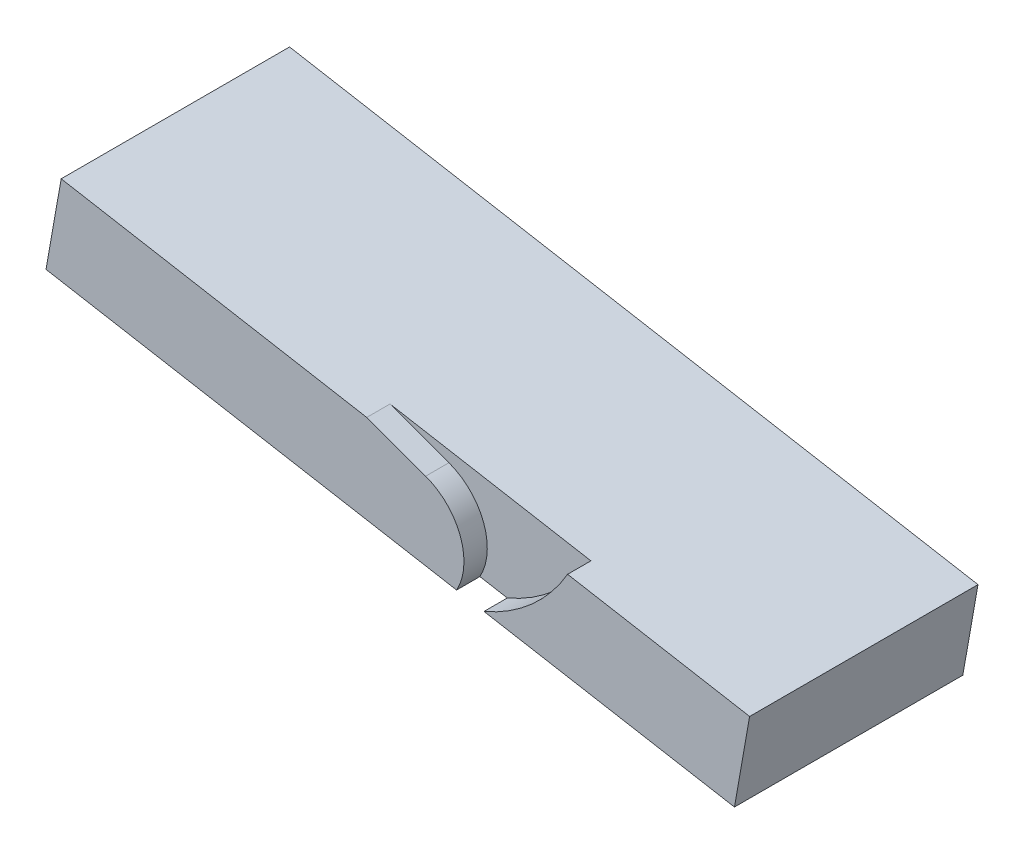
ISO-10303-21;
HEADER;
FILE_DESCRIPTION(('STEP AP214'),'2;1');
FILE_NAME('part.step','',(''),(''),'','','');
FILE_SCHEMA(('AUTOMOTIVE_DESIGN { 1 0 10303 214 1 1 1 1 }'));
ENDSEC;
DATA;
#1=APPLICATION_CONTEXT('core data for automotive mechanical design processes');
#2=APPLICATION_PROTOCOL_DEFINITION('international standard','automotive_design',2000,#1);
#3=PRODUCT_CONTEXT('',#1,'mechanical');
#4=PRODUCT('Part','Part','',(#3));
#5=PRODUCT_RELATED_PRODUCT_CATEGORY('part','',(#4));
#6=PRODUCT_DEFINITION_FORMATION('','',#4);
#7=PRODUCT_DEFINITION_CONTEXT('part definition',#1,'design');
#8=PRODUCT_DEFINITION('design','',#6,#7);
#9=PRODUCT_DEFINITION_SHAPE('','',#8);
#10=(LENGTH_UNIT() NAMED_UNIT(*) SI_UNIT(.MILLI.,.METRE.));
#11=(NAMED_UNIT(*) PLANE_ANGLE_UNIT() SI_UNIT($,.RADIAN.));
#12=(NAMED_UNIT(*) SI_UNIT($,.STERADIAN.) SOLID_ANGLE_UNIT());
#13=UNCERTAINTY_MEASURE_WITH_UNIT(LENGTH_MEASURE(1.E-05),#10,'distance_accuracy_value','');
#14=(GEOMETRIC_REPRESENTATION_CONTEXT(3) GLOBAL_UNCERTAINTY_ASSIGNED_CONTEXT((#13)) GLOBAL_UNIT_ASSIGNED_CONTEXT((#10,
#11,#12)) REPRESENTATION_CONTEXT('',''));
#15=CARTESIAN_POINT('',(0.,0.,0.));
#16=DIRECTION('',(0.,0.,1.));
#17=DIRECTION('',(1.,0.,0.));
#18=AXIS2_PLACEMENT_3D('',#15,#16,#17);
#19=CARTESIAN_POINT('',(-4.34365582023604,-40.135903716019,3.048));
#20=DIRECTION('',(0.,0.,-1.));
#21=DIRECTION('',(-1.,0.,0.));
#22=AXIS2_PLACEMENT_3D('',#19,#20,#21);
#23=CYLINDRICAL_SURFACE('',#22,12.7);
#24=CARTESIAN_POINT('',(-4.34365582023604,-40.135903716019,-3.048));
#25=DIRECTION('',(0.,0.,1.));
#26=DIRECTION('',(1.,0.,0.));
#27=AXIS2_PLACEMENT_3D('',#24,#25,#26);
#28=CIRCLE('',#27,12.7);
#29=CARTESIAN_POINT('',(6.74608058450968,-46.325228919404,-3.048));
#30=VERTEX_POINT('',#29);
#31=CARTESIAN_POINT('',(0.,-28.2018074320379,-3.048));
#32=VERTEX_POINT('',#31);
#33=EDGE_CURVE('E127',#30,#32,#28,.T.);
#34=ORIENTED_EDGE('',*,*,#33,.T.);
#35=DIRECTION('',(0.,0.,-1.));
#36=VECTOR('',#35,1.);
#37=CARTESIAN_POINT('',(0.,-28.2018074320379,3.048));
#38=LINE('',#37,#36);
#39=CARTESIAN_POINT('',(0.,-28.2018074320379,2.032));
#40=VERTEX_POINT('',#39);
#41=EDGE_CURVE('E113',#40,#32,#38,.T.);
#42=ORIENTED_EDGE('',*,*,#41,.F.);
#43=CARTESIAN_POINT('',(-4.34365582023604,-40.135903716019,2.032));
#44=DIRECTION('',(0.,0.,1.));
#45=DIRECTION('',(1.,0.,0.));
#46=AXIS2_PLACEMENT_3D('',#43,#44,#45);
#47=CIRCLE('',#46,12.7);
#48=CARTESIAN_POINT('',(6.74608058450968,-46.325228919404,2.032));
#49=VERTEX_POINT('',#48);
#50=EDGE_CURVE('E123',#40,#49,#47,.F.);
#51=ORIENTED_EDGE('',*,*,#50,.T.);
#52=DIRECTION('',(0.,0.,-1.));
#53=VECTOR('',#52,1.);
#54=CARTESIAN_POINT('',(6.74608058450968,-46.325228919404,3.048));
#55=LINE('',#54,#53);
#56=EDGE_CURVE('E128',#30,#49,#55,.F.);
#57=ORIENTED_EDGE('',*,*,#56,.F.);
#58=EDGE_LOOP('',(#34,#42,#51,#57));
#59=FACE_BOUND('',#58,.T.);
#60=ADVANCED_FACE('F37',(#59),#23,.T.);
#61=CARTESIAN_POINT('',(-9.06388619403997,-24.902822650631,3.048));
#62=DIRECTION('',(-0.342020143325673,-0.939692620785907,0.));
#63=DIRECTION('',(0.939692620785907,-0.342020143325673,0.));
#64=AXIS2_PLACEMENT_3D('',#61,#62,#63);
#65=PLANE('',#64);
#66=DIRECTION('',(0.939692620785907,-0.342020143325673,0.));
#67=VECTOR('',#66,1.);
#68=CARTESIAN_POINT('',(-9.06388619403997,-24.902822650631,2.032));
#69=LINE('',#68,#67);
#70=CARTESIAN_POINT('',(-12.8433687033597,-23.5272035163089,2.032));
#71=VERTEX_POINT('',#70);
#72=EDGE_CURVE('E120',#71,#40,#69,.T.);
#73=ORIENTED_EDGE('',*,*,#72,.T.);
#74=ORIENTED_EDGE('',*,*,#41,.T.);
#75=DIRECTION('',(-0.939692620785907,0.342020143325673,0.));
#76=VECTOR('',#75,1.);
#77=CARTESIAN_POINT('',(-9.06388619403997,-24.902822650631,-3.048));
#78=LINE('',#77,#76);
#79=CARTESIAN_POINT('',(-12.8433687033593,-23.527203516309,-3.048));
#80=VERTEX_POINT('',#79);
#81=EDGE_CURVE('E117',#32,#80,#78,.T.);
#82=ORIENTED_EDGE('',*,*,#81,.T.);
#83=DIRECTION('',(0.,0.,-1.));
#84=VECTOR('',#83,1.);
#85=CARTESIAN_POINT('',(-12.8433687033593,-23.527203516309,162.968548839141));
#86=LINE('',#85,#84);
#87=EDGE_CURVE('E150',#71,#80,#86,.T.);
#88=ORIENTED_EDGE('',*,*,#87,.F.);
#89=EDGE_LOOP('',(#73,#74,#82,#88));
#90=FACE_BOUND('',#89,.T.);
#91=ADVANCED_FACE('F115',(#90),#65,.F.);
#92=CARTESIAN_POINT('',(0.,0.,-3.048));
#93=DIRECTION('',(0.,0.,1.));
#94=DIRECTION('',(1.,0.,0.));
#95=AXIS2_PLACEMENT_3D('',#92,#93,#94);
#96=PLANE('',#95);
#97=DIRECTION('',(0.984807753012207,-0.173648177666934,0.));
#98=VECTOR('',#97,1.);
#99=CARTESIAN_POINT('',(-82.7610122768255,-30.5427134831723,-3.048));
#100=LINE('',#99,#98);
#101=CARTESIAN_POINT('',(12.7189421269623,-47.3784055613744,-3.048));
#102=VERTEX_POINT('',#101);
#103=EDGE_CURVE('E144',#30,#102,#100,.T.);
#104=ORIENTED_EDGE('',*,*,#103,.T.);
#105=CARTESIAN_POINT('',(-2.48342826754325,-11.827752618226,-3.048));
#106=DIRECTION('',(0.,0.,1.));
#107=DIRECTION('',(1.,0.,0.));
#108=AXIS2_PLACEMENT_3D('',#105,#106,#107);
#109=CIRCLE('',#108,38.6647254004982);
#110=CARTESIAN_POINT('',(30.9496738199748,-31.2490984804861,-3.048));
#111=VERTEX_POINT('',#110);
#112=EDGE_CURVE('E124',#102,#111,#109,.T.);
#113=ORIENTED_EDGE('',*,*,#112,.T.);
#114=DIRECTION('',(-0.984807753012207,0.173648177666934,0.));
#115=VECTOR('',#114,1.);
#116=CARTESIAN_POINT('',(-79.4530144922704,-11.7821257882897,-3.048));
#117=LINE('',#116,#115);
#118=EDGE_CURVE('E133',#111,#80,#117,.T.);
#119=ORIENTED_EDGE('',*,*,#118,.T.);
#120=ORIENTED_EDGE('',*,*,#81,.F.);
#121=ORIENTED_EDGE('',*,*,#33,.F.);
#122=EDGE_LOOP('',(#104,#113,#119,#120,#121));
#123=FACE_BOUND('',#122,.T.);
#124=ADVANCED_FACE('F39',(#123),#96,.T.);
#125=CARTESIAN_POINT('',(-2.48342826754325,-11.827752618226,3.048));
#126=DIRECTION('',(0.,0.,-1.));
#127=DIRECTION('',(-1.,0.,0.));
#128=AXIS2_PLACEMENT_3D('',#125,#126,#127);
#129=CYLINDRICAL_SURFACE('',#128,38.6647254004982);
#130=DIRECTION('',(0.,0.,-1.));
#131=VECTOR('',#130,1.);
#132=CARTESIAN_POINT('',(12.7189421269623,-47.3784055613744,3.048));
#133=LINE('',#132,#131);
#134=CARTESIAN_POINT('',(12.7189421269623,-47.3784055613744,2.032));
#135=VERTEX_POINT('',#134);
#136=EDGE_CURVE('E146',#102,#135,#133,.F.);
#137=ORIENTED_EDGE('',*,*,#136,.T.);
#138=CARTESIAN_POINT('',(-2.48342826754325,-11.827752618226,2.032));
#139=DIRECTION('',(0.,0.,1.));
#140=DIRECTION('',(1.,0.,0.));
#141=AXIS2_PLACEMENT_3D('',#138,#139,#140);
#142=CIRCLE('',#141,38.6647254004982);
#143=CARTESIAN_POINT('',(30.9496738199748,-31.2490984804861,2.032));
#144=VERTEX_POINT('',#143);
#145=EDGE_CURVE('E152',#144,#135,#142,.F.);
#146=ORIENTED_EDGE('',*,*,#145,.F.);
#147=DIRECTION('',(0.,0.,-1.));
#148=VECTOR('',#147,1.);
#149=CARTESIAN_POINT('',(30.9496738199748,-31.2490984804861,3.048));
#150=LINE('',#149,#148);
#151=EDGE_CURVE('E141',#144,#111,#150,.T.);
#152=ORIENTED_EDGE('',*,*,#151,.T.);
#153=ORIENTED_EDGE('',*,*,#112,.F.);
#154=EDGE_LOOP('',(#137,#146,#152,#153));
#155=FACE_BOUND('',#154,.T.);
#156=ADVANCED_FACE('F196',(#155),#129,.F.);
#157=CARTESIAN_POINT('',(-82.7610122768255,-30.5427134831723,162.968548839141));
#158=DIRECTION('',(0.173648177666934,0.984807753012207,0.));
#159=DIRECTION('',(-0.984807753012207,0.173648177666934,0.));
#160=AXIS2_PLACEMENT_3D('',#157,#158,#159);
#161=PLANE('',#160);
#162=ORIENTED_EDGE('',*,*,#136,.F.);
#163=ORIENTED_EDGE('',*,*,#103,.F.);
#164=ORIENTED_EDGE('',*,*,#56,.T.);
#165=DIRECTION('',(0.984807753012207,-0.173648177666934,0.));
#166=VECTOR('',#165,1.);
#167=CARTESIAN_POINT('',(-82.7610122768255,-30.5427134831723,2.03200000000001));
#168=LINE('',#167,#166);
#169=CARTESIAN_POINT('',(-82.7610122768255,-30.5427134831723,2.03200000000001));
#170=VERTEX_POINT('',#169);
#171=EDGE_CURVE('E154',#170,#49,#168,.T.);
#172=ORIENTED_EDGE('',*,*,#171,.F.);
#173=DIRECTION('',(0.,0.,-1.));
#174=VECTOR('',#173,1.);
#175=CARTESIAN_POINT('',(-82.7610122768255,-30.5427134831723,162.968548839141));
#176=LINE('',#175,#174);
#177=CARTESIAN_POINT('',(-82.7610122768255,-30.5427134831723,-47.752));
#178=VERTEX_POINT('',#177);
#179=EDGE_CURVE('E61',#170,#178,#176,.T.);
#180=ORIENTED_EDGE('',*,*,#179,.T.);
#181=DIRECTION('',(-0.984807753012207,0.173648177666934,0.));
#182=VECTOR('',#181,1.);
#183=CARTESIAN_POINT('',(-82.7610122768255,-30.5427134831723,-47.752));
#184=LINE('',#183,#182);
#185=CARTESIAN_POINT('',(67.323689282235,-57.006695759613,-47.752));
#186=VERTEX_POINT('',#185);
#187=EDGE_CURVE('E167',#186,#178,#184,.T.);
#188=ORIENTED_EDGE('',*,*,#187,.F.);
#189=DIRECTION('',(0.,0.,-1.));
#190=VECTOR('',#189,1.);
#191=CARTESIAN_POINT('',(67.323689282235,-57.006695759613,162.968548839141));
#192=LINE('',#191,#190);
#193=CARTESIAN_POINT('',(67.323689282235,-57.006695759613,2.03200000000001));
#194=VERTEX_POINT('',#193);
#195=EDGE_CURVE('E54',#194,#186,#192,.T.);
#196=ORIENTED_EDGE('',*,*,#195,.F.);
#197=EDGE_CURVE('E156',#135,#194,#168,.T.);
#198=ORIENTED_EDGE('',*,*,#197,.F.);
#199=EDGE_LOOP('',(#162,#163,#164,#172,#180,#188,#196,#198));
#200=FACE_BOUND('',#199,.T.);
#201=ADVANCED_FACE('F199',(#200),#161,.F.);
#202=CARTESIAN_POINT('',(-79.4530144922704,-11.7821257882897,162.968548839141));
#203=DIRECTION('',(-0.173648177666934,-0.984807753012207,0.));
#204=DIRECTION('',(0.984807753012207,-0.173648177666934,0.));
#205=AXIS2_PLACEMENT_3D('',#202,#203,#204);
#206=PLANE('',#205);
#207=ORIENTED_EDGE('',*,*,#151,.F.);
#208=DIRECTION('',(-0.984807753012207,0.173648177666934,0.));
#209=VECTOR('',#208,1.);
#210=CARTESIAN_POINT('',(-79.4530144922704,-11.7821257882897,2.03200000000001));
#211=LINE('',#210,#209);
#212=CARTESIAN_POINT('',(70.6316870667901,-38.2461080647305,2.03200000000001));
#213=VERTEX_POINT('',#212);
#214=EDGE_CURVE('E41',#213,#144,#211,.T.);
#215=ORIENTED_EDGE('',*,*,#214,.F.);
#216=DIRECTION('',(0.,0.,-1.));
#217=VECTOR('',#216,1.);
#218=CARTESIAN_POINT('',(70.6316870667901,-38.2461080647305,162.968548839141));
#219=LINE('',#218,#217);
#220=CARTESIAN_POINT('',(70.6316870667901,-38.2461080647305,-47.752));
#221=VERTEX_POINT('',#220);
#222=EDGE_CURVE('E180',#213,#221,#219,.T.);
#223=ORIENTED_EDGE('',*,*,#222,.T.);
#224=DIRECTION('',(0.984807753012207,-0.173648177666934,0.));
#225=VECTOR('',#224,1.);
#226=CARTESIAN_POINT('',(-79.4530144922704,-11.7821257882897,-47.752));
#227=LINE('',#226,#225);
#228=CARTESIAN_POINT('',(-79.4530144922704,-11.7821257882897,-47.752));
#229=VERTEX_POINT('',#228);
#230=EDGE_CURVE('E46',#229,#221,#227,.T.);
#231=ORIENTED_EDGE('',*,*,#230,.F.);
#232=DIRECTION('',(0.,0.,-1.));
#233=VECTOR('',#232,1.);
#234=CARTESIAN_POINT('',(-79.4530144922704,-11.7821257882897,162.968548839141));
#235=LINE('',#234,#233);
#236=CARTESIAN_POINT('',(-79.4530144922704,-11.7821257882897,2.03200000000001));
#237=VERTEX_POINT('',#236);
#238=EDGE_CURVE('E170',#237,#229,#235,.T.);
#239=ORIENTED_EDGE('',*,*,#238,.F.);
#240=EDGE_CURVE('E182',#71,#237,#211,.T.);
#241=ORIENTED_EDGE('',*,*,#240,.F.);
#242=ORIENTED_EDGE('',*,*,#87,.T.);
#243=ORIENTED_EDGE('',*,*,#118,.F.);
#244=EDGE_LOOP('',(#207,#215,#223,#231,#239,#241,#242,#243));
#245=FACE_BOUND('',#244,.T.);
#246=ADVANCED_FACE('F184',(#245),#206,.F.);
#247=CARTESIAN_POINT('',(0.,0.,2.032));
#248=DIRECTION('',(0.,0.,1.));
#249=DIRECTION('',(1.,0.,0.));
#250=AXIS2_PLACEMENT_3D('',#247,#248,#249);
#251=PLANE('',#250);
#252=ORIENTED_EDGE('',*,*,#72,.F.);
#253=ORIENTED_EDGE('',*,*,#240,.T.);
#254=DIRECTION('',(-0.173648177666933,-0.984807753012208,0.));
#255=VECTOR('',#254,1.);
#256=CARTESIAN_POINT('',(-79.4530144922704,-11.7821257882897,2.03200000000001));
#257=LINE('',#256,#255);
#258=EDGE_CURVE('E159',#237,#170,#257,.T.);
#259=ORIENTED_EDGE('',*,*,#258,.T.);
#260=ORIENTED_EDGE('',*,*,#171,.T.);
#261=ORIENTED_EDGE('',*,*,#50,.F.);
#262=EDGE_LOOP('',(#252,#253,#259,#260,#261));
#263=FACE_BOUND('',#262,.T.);
#264=ADVANCED_FACE('F187',(#263),#251,.T.);
#265=CARTESIAN_POINT('',(-79.4530144922704,-11.7821257882897,162.968548839141));
#266=DIRECTION('',(0.984807753012208,-0.173648177666933,0.));
#267=DIRECTION('',(0.173648177666933,0.984807753012208,0.));
#268=AXIS2_PLACEMENT_3D('',#265,#266,#267);
#269=PLANE('',#268);
#270=ORIENTED_EDGE('',*,*,#258,.F.);
#271=ORIENTED_EDGE('',*,*,#238,.T.);
#272=DIRECTION('',(0.173648177666933,0.984807753012208,0.));
#273=VECTOR('',#272,1.);
#274=CARTESIAN_POINT('',(-79.4530144922704,-11.7821257882897,-47.752));
#275=LINE('',#274,#273);
#276=EDGE_CURVE('E169',#178,#229,#275,.T.);
#277=ORIENTED_EDGE('',*,*,#276,.F.);
#278=ORIENTED_EDGE('',*,*,#179,.F.);
#279=EDGE_LOOP('',(#270,#271,#277,#278));
#280=FACE_BOUND('',#279,.T.);
#281=ADVANCED_FACE('F190',(#280),#269,.F.);
#282=CARTESIAN_POINT('',(70.6316870667901,-38.2461080647305,162.968548839141));
#283=DIRECTION('',(-0.984807753012207,0.173648177666936,0.));
#284=DIRECTION('',(-0.173648177666936,-0.984807753012207,0.));
#285=AXIS2_PLACEMENT_3D('',#282,#283,#284);
#286=PLANE('',#285);
#287=DIRECTION('',(0.173648177666936,0.984807753012207,0.));
#288=VECTOR('',#287,1.);
#289=CARTESIAN_POINT('',(70.6316870667901,-38.2461080647305,2.03200000000001));
#290=LINE('',#289,#288);
#291=EDGE_CURVE('E153',#194,#213,#290,.T.);
#292=ORIENTED_EDGE('',*,*,#291,.F.);
#293=ORIENTED_EDGE('',*,*,#195,.T.);
#294=DIRECTION('',(-0.173648177666936,-0.984807753012207,0.));
#295=VECTOR('',#294,1.);
#296=CARTESIAN_POINT('',(70.6316870667901,-38.2461080647305,-47.752));
#297=LINE('',#296,#295);
#298=EDGE_CURVE('E11',#221,#186,#297,.T.);
#299=ORIENTED_EDGE('',*,*,#298,.F.);
#300=ORIENTED_EDGE('',*,*,#222,.F.);
#301=EDGE_LOOP('',(#292,#293,#299,#300));
#302=FACE_BOUND('',#301,.T.);
#303=ADVANCED_FACE('F179',(#302),#286,.F.);
#304=ORIENTED_EDGE('',*,*,#214,.T.);
#305=ORIENTED_EDGE('',*,*,#145,.T.);
#306=ORIENTED_EDGE('',*,*,#197,.T.);
#307=ORIENTED_EDGE('',*,*,#291,.T.);
#308=EDGE_LOOP('',(#304,#305,#306,#307));
#309=FACE_BOUND('',#308,.T.);
#310=ADVANCED_FACE('F198',(#309),#251,.T.);
#311=CARTESIAN_POINT('',(0.,0.,-47.752));
#312=DIRECTION('',(0.,0.,1.));
#313=DIRECTION('',(1.,0.,0.));
#314=AXIS2_PLACEMENT_3D('',#311,#312,#313);
#315=PLANE('',#314);
#316=ORIENTED_EDGE('',*,*,#276,.T.);
#317=ORIENTED_EDGE('',*,*,#230,.T.);
#318=ORIENTED_EDGE('',*,*,#298,.T.);
#319=ORIENTED_EDGE('',*,*,#187,.T.);
#320=EDGE_LOOP('',(#316,#317,#318,#319));
#321=FACE_BOUND('',#320,.T.);
#322=ADVANCED_FACE('F175',(#321),#315,.F.);
#323=CLOSED_SHELL('',(#60,#91,#124,#156,#201,#246,#264,#281,#303,#310,#322));
#324=MANIFOLD_SOLID_BREP('B2',#323);
#325=ADVANCED_BREP_SHAPE_REPRESENTATION('',(#18,#324),#14);
#326=SHAPE_DEFINITION_REPRESENTATION(#9,#325);
ENDSEC;
END-ISO-10303-21;
